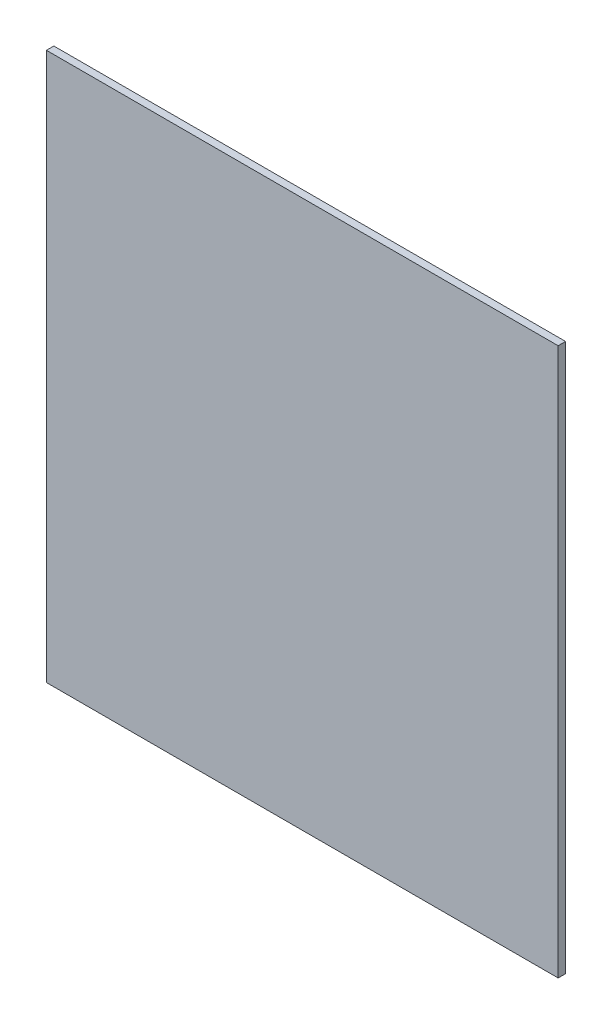
ISO-10303-21;
HEADER;
FILE_DESCRIPTION(('STEP AP214'),'2;1');
FILE_NAME('part.step','',(''),(''),'','','');
FILE_SCHEMA(('AUTOMOTIVE_DESIGN { 1 0 10303 214 1 1 1 1 }'));
ENDSEC;
DATA;
#1=APPLICATION_CONTEXT('core data for automotive mechanical design processes');
#2=APPLICATION_PROTOCOL_DEFINITION('international standard','automotive_design',2000,#1);
#3=PRODUCT_CONTEXT('',#1,'mechanical');
#4=PRODUCT('Part','Part','',(#3));
#5=PRODUCT_RELATED_PRODUCT_CATEGORY('part','',(#4));
#6=PRODUCT_DEFINITION_FORMATION('','',#4);
#7=PRODUCT_DEFINITION_CONTEXT('part definition',#1,'design');
#8=PRODUCT_DEFINITION('design','',#6,#7);
#9=PRODUCT_DEFINITION_SHAPE('','',#8);
#10=(LENGTH_UNIT() NAMED_UNIT(*) SI_UNIT(.MILLI.,.METRE.));
#11=(NAMED_UNIT(*) PLANE_ANGLE_UNIT() SI_UNIT($,.RADIAN.));
#12=(NAMED_UNIT(*) SI_UNIT($,.STERADIAN.) SOLID_ANGLE_UNIT());
#13=UNCERTAINTY_MEASURE_WITH_UNIT(LENGTH_MEASURE(1.E-05),#10,'distance_accuracy_value','');
#14=(GEOMETRIC_REPRESENTATION_CONTEXT(3) GLOBAL_UNCERTAINTY_ASSIGNED_CONTEXT((#13)) GLOBAL_UNIT_ASSIGNED_CONTEXT((#10,
#11,#12)) REPRESENTATION_CONTEXT('',''));
#15=CARTESIAN_POINT('',(0.,0.,0.));
#16=DIRECTION('',(0.,0.,1.));
#17=DIRECTION('',(1.,0.,0.));
#18=AXIS2_PLACEMENT_3D('',#15,#16,#17);
#19=CARTESIAN_POINT('',(100.,107.,2.9));
#20=DIRECTION('',(-1.,0.,0.));
#21=DIRECTION('',(0.,-1.,0.));
#22=AXIS2_PLACEMENT_3D('',#19,#20,#21);
#23=PLANE('',#22);
#24=DIRECTION('',(0.,1.,0.));
#25=VECTOR('',#24,1.);
#26=CARTESIAN_POINT('',(100.,107.,0.));
#27=LINE('',#26,#25);
#28=CARTESIAN_POINT('',(100.,-107.,0.));
#29=VERTEX_POINT('',#28);
#30=CARTESIAN_POINT('',(100.,107.,0.));
#31=VERTEX_POINT('',#30);
#32=EDGE_CURVE('E97',#29,#31,#27,.T.);
#33=ORIENTED_EDGE('',*,*,#32,.T.);
#34=DIRECTION('',(0.,0.,-1.));
#35=VECTOR('',#34,1.);
#36=CARTESIAN_POINT('',(100.,107.,2.9));
#37=LINE('',#36,#35);
#38=CARTESIAN_POINT('',(100.,107.,2.9));
#39=VERTEX_POINT('',#38);
#40=EDGE_CURVE('E11',#39,#31,#37,.T.);
#41=ORIENTED_EDGE('',*,*,#40,.F.);
#42=DIRECTION('',(0.,1.,0.));
#43=VECTOR('',#42,1.);
#44=CARTESIAN_POINT('',(100.,107.,2.9));
#45=LINE('',#44,#43);
#46=CARTESIAN_POINT('',(100.,-107.,2.9));
#47=VERTEX_POINT('',#46);
#48=EDGE_CURVE('E85',#47,#39,#45,.T.);
#49=ORIENTED_EDGE('',*,*,#48,.F.);
#50=DIRECTION('',(0.,0.,-1.));
#51=VECTOR('',#50,1.);
#52=CARTESIAN_POINT('',(100.,-107.,2.9));
#53=LINE('',#52,#51);
#54=EDGE_CURVE('E93',#47,#29,#53,.T.);
#55=ORIENTED_EDGE('',*,*,#54,.T.);
#56=EDGE_LOOP('',(#33,#41,#49,#55));
#57=FACE_BOUND('',#56,.T.);
#58=ADVANCED_FACE('F34',(#57),#23,.F.);
#59=CARTESIAN_POINT('',(-100.,107.,2.9));
#60=DIRECTION('',(0.,-1.,0.));
#61=DIRECTION('',(0.,0.,-1.));
#62=AXIS2_PLACEMENT_3D('',#59,#60,#61);
#63=PLANE('',#62);
#64=DIRECTION('',(-1.,0.,0.));
#65=VECTOR('',#64,1.);
#66=CARTESIAN_POINT('',(-100.,107.,0.));
#67=LINE('',#66,#65);
#68=CARTESIAN_POINT('',(-100.,107.,0.));
#69=VERTEX_POINT('',#68);
#70=EDGE_CURVE('E89',#31,#69,#67,.T.);
#71=ORIENTED_EDGE('',*,*,#70,.T.);
#72=DIRECTION('',(0.,0.,-1.));
#73=VECTOR('',#72,1.);
#74=CARTESIAN_POINT('',(-100.,107.,2.9));
#75=LINE('',#74,#73);
#76=CARTESIAN_POINT('',(-100.,107.,2.9));
#77=VERTEX_POINT('',#76);
#78=EDGE_CURVE('E42',#77,#69,#75,.T.);
#79=ORIENTED_EDGE('',*,*,#78,.F.);
#80=DIRECTION('',(-1.,0.,0.));
#81=VECTOR('',#80,1.);
#82=CARTESIAN_POINT('',(-100.,107.,2.9));
#83=LINE('',#82,#81);
#84=EDGE_CURVE('E80',#39,#77,#83,.T.);
#85=ORIENTED_EDGE('',*,*,#84,.F.);
#86=ORIENTED_EDGE('',*,*,#40,.T.);
#87=EDGE_LOOP('',(#71,#79,#85,#86));
#88=FACE_BOUND('',#87,.T.);
#89=ADVANCED_FACE('F88',(#88),#63,.F.);
#90=CARTESIAN_POINT('',(-100.,107.,2.9));
#91=DIRECTION('',(1.,0.,0.));
#92=DIRECTION('',(0.,1.,0.));
#93=AXIS2_PLACEMENT_3D('',#90,#91,#92);
#94=PLANE('',#93);
#95=DIRECTION('',(0.,-1.,0.));
#96=VECTOR('',#95,1.);
#97=CARTESIAN_POINT('',(-100.,107.,0.));
#98=LINE('',#97,#96);
#99=CARTESIAN_POINT('',(-100.,-107.,0.));
#100=VERTEX_POINT('',#99);
#101=EDGE_CURVE('E67',#69,#100,#98,.T.);
#102=ORIENTED_EDGE('',*,*,#101,.T.);
#103=DIRECTION('',(0.,0.,-1.));
#104=VECTOR('',#103,1.);
#105=CARTESIAN_POINT('',(-100.,-107.,2.9));
#106=LINE('',#105,#104);
#107=CARTESIAN_POINT('',(-100.,-107.,2.9));
#108=VERTEX_POINT('',#107);
#109=EDGE_CURVE('E90',#108,#100,#106,.T.);
#110=ORIENTED_EDGE('',*,*,#109,.F.);
#111=DIRECTION('',(0.,-1.,0.));
#112=VECTOR('',#111,1.);
#113=CARTESIAN_POINT('',(-100.,107.,2.9));
#114=LINE('',#113,#112);
#115=EDGE_CURVE('E83',#77,#108,#114,.T.);
#116=ORIENTED_EDGE('',*,*,#115,.F.);
#117=ORIENTED_EDGE('',*,*,#78,.T.);
#118=EDGE_LOOP('',(#102,#110,#116,#117));
#119=FACE_BOUND('',#118,.T.);
#120=ADVANCED_FACE('F91',(#119),#94,.F.);
#121=CARTESIAN_POINT('',(-100.,-107.,2.9));
#122=DIRECTION('',(0.,1.,0.));
#123=DIRECTION('',(0.,0.,1.));
#124=AXIS2_PLACEMENT_3D('',#121,#122,#123);
#125=PLANE('',#124);
#126=DIRECTION('',(1.,0.,0.));
#127=VECTOR('',#126,1.);
#128=CARTESIAN_POINT('',(-100.,-107.,0.));
#129=LINE('',#128,#127);
#130=EDGE_CURVE('E73',#100,#29,#129,.T.);
#131=ORIENTED_EDGE('',*,*,#130,.T.);
#132=ORIENTED_EDGE('',*,*,#54,.F.);
#133=DIRECTION('',(1.,0.,0.));
#134=VECTOR('',#133,1.);
#135=CARTESIAN_POINT('',(-100.,-107.,2.9));
#136=LINE('',#135,#134);
#137=EDGE_CURVE('E50',#108,#47,#136,.T.);
#138=ORIENTED_EDGE('',*,*,#137,.F.);
#139=ORIENTED_EDGE('',*,*,#109,.T.);
#140=EDGE_LOOP('',(#131,#132,#138,#139));
#141=FACE_BOUND('',#140,.T.);
#142=ADVANCED_FACE('F104',(#141),#125,.F.);
#143=CARTESIAN_POINT('',(0.,0.,2.9));
#144=DIRECTION('',(0.,0.,1.));
#145=DIRECTION('',(1.,0.,0.));
#146=AXIS2_PLACEMENT_3D('',#143,#144,#145);
#147=PLANE('',#146);
#148=ORIENTED_EDGE('',*,*,#48,.T.);
#149=ORIENTED_EDGE('',*,*,#84,.T.);
#150=ORIENTED_EDGE('',*,*,#115,.T.);
#151=ORIENTED_EDGE('',*,*,#137,.T.);
#152=EDGE_LOOP('',(#148,#149,#150,#151));
#153=FACE_BOUND('',#152,.T.);
#154=ADVANCED_FACE('F81',(#153),#147,.T.);
#155=CARTESIAN_POINT('',(0.,0.,0.));
#156=DIRECTION('',(0.,0.,1.));
#157=DIRECTION('',(1.,0.,0.));
#158=AXIS2_PLACEMENT_3D('',#155,#156,#157);
#159=PLANE('',#158);
#160=ORIENTED_EDGE('',*,*,#32,.F.);
#161=ORIENTED_EDGE('',*,*,#130,.F.);
#162=ORIENTED_EDGE('',*,*,#101,.F.);
#163=ORIENTED_EDGE('',*,*,#70,.F.);
#164=EDGE_LOOP('',(#160,#161,#162,#163));
#165=FACE_BOUND('',#164,.T.);
#166=ADVANCED_FACE('F107',(#165),#159,.F.);
#167=CLOSED_SHELL('',(#58,#89,#120,#142,#154,#166));
#168=MANIFOLD_SOLID_BREP('B2',#167);
#169=ADVANCED_BREP_SHAPE_REPRESENTATION('',(#18,#168),#14);
#170=SHAPE_DEFINITION_REPRESENTATION(#9,#169);
ENDSEC;
END-ISO-10303-21;
